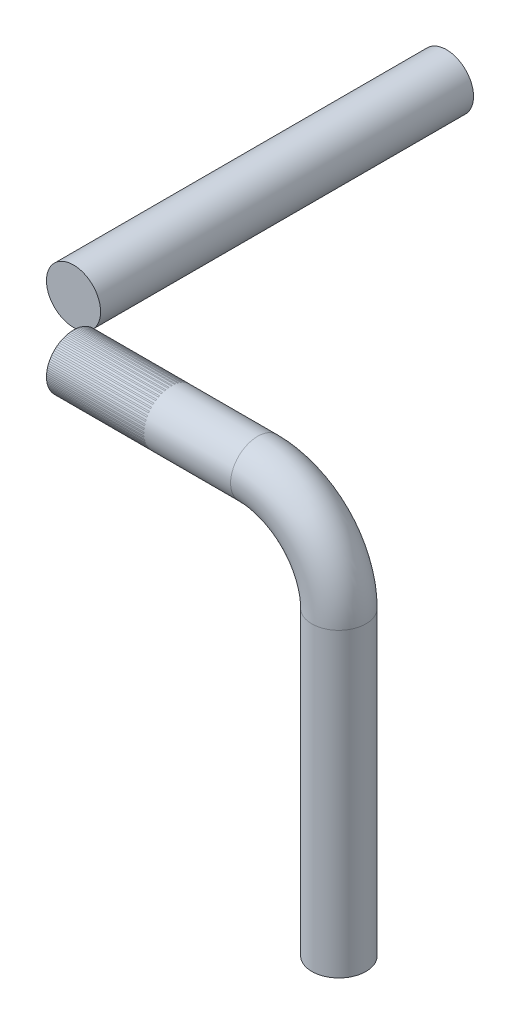
ISO-10303-21;
HEADER;
FILE_DESCRIPTION(('STEP AP214'),'2;1');
FILE_NAME('part.step','',(''),(''),'','','');
FILE_SCHEMA(('AUTOMOTIVE_DESIGN { 1 0 10303 214 1 1 1 1 }'));
ENDSEC;
DATA;
#1=APPLICATION_CONTEXT('core data for automotive mechanical design processes');
#2=APPLICATION_PROTOCOL_DEFINITION('international standard','automotive_design',2000,#1);
#3=PRODUCT_CONTEXT('',#1,'mechanical');
#4=PRODUCT('Part','Part','',(#3));
#5=PRODUCT_RELATED_PRODUCT_CATEGORY('part','',(#4));
#6=PRODUCT_DEFINITION_FORMATION('','',#4);
#7=PRODUCT_DEFINITION_CONTEXT('part definition',#1,'design');
#8=PRODUCT_DEFINITION('design','',#6,#7);
#9=PRODUCT_DEFINITION_SHAPE('','',#8);
#10=(LENGTH_UNIT() NAMED_UNIT(*) SI_UNIT(.MILLI.,.METRE.));
#11=(NAMED_UNIT(*) PLANE_ANGLE_UNIT() SI_UNIT($,.RADIAN.));
#12=(NAMED_UNIT(*) SI_UNIT($,.STERADIAN.) SOLID_ANGLE_UNIT());
#13=UNCERTAINTY_MEASURE_WITH_UNIT(LENGTH_MEASURE(1.E-05),#10,'distance_accuracy_value','');
#14=(GEOMETRIC_REPRESENTATION_CONTEXT(3) GLOBAL_UNCERTAINTY_ASSIGNED_CONTEXT((#13)) GLOBAL_UNIT_ASSIGNED_CONTEXT((#10,
#11,#12)) REPRESENTATION_CONTEXT('',''));
#15=CARTESIAN_POINT('',(0.,0.,0.));
#16=DIRECTION('',(0.,0.,1.));
#17=DIRECTION('',(1.,0.,0.));
#18=AXIS2_PLACEMENT_3D('',#15,#16,#17);
#19=CARTESIAN_POINT('',(0.,0.,84.0740000000007));
#20=DIRECTION('',(0.,0.,-1.));
#21=DIRECTION('',(-1.,0.,0.));
#22=AXIS2_PLACEMENT_3D('',#19,#20,#21);
#23=PLANE('',#22);
#24=CARTESIAN_POINT('',(0.,0.,84.0740000000007));
#25=DIRECTION('',(0.,0.,-1.));
#26=DIRECTION('',(-1.,0.,0.));
#27=AXIS2_PLACEMENT_3D('',#24,#25,#26);
#28=CIRCLE('',#27,6.35);
#29=CARTESIAN_POINT('',(-6.35,0.,84.0740000000007));
#30=VERTEX_POINT('',#29);
#31=EDGE_CURVE('E53',#30,#30,#28,.T.);
#32=ORIENTED_EDGE('',*,*,#31,.F.);
#33=EDGE_LOOP('',(#32));
#34=FACE_BOUND('',#33,.T.);
#35=ADVANCED_FACE('F46',(#34),#23,.F.);
#36=CARTESIAN_POINT('',(0.,0.,-21.3387122421383));
#37=DIRECTION('',(0.,0.,1.));
#38=DIRECTION('',(1.,0.,0.));
#39=AXIS2_PLACEMENT_3D('',#36,#37,#38);
#40=CYLINDRICAL_SURFACE('',#39,6.35);
#41=CARTESIAN_POINT('',(0.,0.,-3.37819999999999));
#42=DIRECTION('',(0.,0.,1.));
#43=DIRECTION('',(1.,0.,0.));
#44=AXIS2_PLACEMENT_3D('',#41,#42,#43);
#45=CIRCLE('',#44,6.35);
#46=CARTESIAN_POINT('',(6.35,0.,-3.37819999999999));
#47=VERTEX_POINT('',#46);
#48=EDGE_CURVE('E11',#47,#47,#45,.T.);
#49=ORIENTED_EDGE('',*,*,#48,.T.);
#50=EDGE_LOOP('',(#49));
#51=FACE_BOUND('',#50,.T.);
#52=ORIENTED_EDGE('',*,*,#31,.T.);
#53=EDGE_LOOP('',(#52));
#54=FACE_BOUND('',#53,.T.);
#55=ADVANCED_FACE('F48',(#51,#54),#40,.T.);
#56=CARTESIAN_POINT('',(0.,0.,-3.37819999999999));
#57=DIRECTION('',(0.,0.,1.));
#58=DIRECTION('',(1.,0.,0.));
#59=AXIS2_PLACEMENT_3D('',#56,#57,#58);
#60=PLANE('',#59);
#61=ORIENTED_EDGE('',*,*,#48,.F.);
#62=EDGE_LOOP('',(#61));
#63=FACE_BOUND('',#62,.T.);
#64=ADVANCED_FACE('F64',(#63),#60,.F.);
#65=CLOSED_SHELL('',(#35,#55,#64));
#66=MANIFOLD_SOLID_BREP('B2',#65);
#67=CARTESIAN_POINT('',(56.3814706539702,-3.60822483003176E-13,97.2819999985061));
#68=DIRECTION('',(-1.,0.,0.));
#69=DIRECTION('',(0.,-1.,0.));
#70=AXIS2_PLACEMENT_3D('',#67,#68,#69);
#71=CYLINDRICAL_SURFACE('',#70,6.34999999999999);
#72=CARTESIAN_POINT('',(56.3814706539702,-3.60822483003176E-13,97.2819999985061));
#73=DIRECTION('',(1.,0.,0.));
#74=DIRECTION('',(0.,0.,-1.));
#75=AXIS2_PLACEMENT_3D('',#72,#73,#74);
#76=CIRCLE('',#75,6.34999999999999);
#77=CARTESIAN_POINT('',(56.3814706539702,6.34999999999963,97.2819999985061));
#78=VERTEX_POINT('',#77);
#79=EDGE_CURVE('E101',#78,#78,#76,.T.);
#80=ORIENTED_EDGE('',*,*,#79,.F.);
#81=EDGE_LOOP('',(#80));
#82=FACE_BOUND('',#81,.T.);
#83=CARTESIAN_POINT('',(13.2080000000033,9.34153308865755E-13,97.2819999985061));
#84=DIRECTION('',(1.,0.,0.));
#85=DIRECTION('',(0.,0.,-1.));
#86=AXIS2_PLACEMENT_3D('',#83,#84,#85);
#87=CIRCLE('',#86,6.34999999999999);
#88=CARTESIAN_POINT('',(13.2080000000033,9.34153308865755E-13,90.9319999985061));
#89=VERTEX_POINT('',#88);
#90=EDGE_CURVE('E45',#89,#89,#87,.T.);
#91=ORIENTED_EDGE('',*,*,#90,.T.);
#92=EDGE_LOOP('',(#91));
#93=FACE_BOUND('',#92,.T.);
#94=ADVANCED_FACE('F95',(#82,#93),#71,.T.);
#95=CARTESIAN_POINT('',(56.3814706539702,-19.05,97.2819999985061));
#96=DIRECTION('',(0.,0.,1.));
#97=DIRECTION('',(1.,0.,0.));
#98=AXIS2_PLACEMENT_3D('',#95,#96,#97);
#99=TOROIDAL_SURFACE('',#98,19.0499999999996,6.34999999999999);
#100=CARTESIAN_POINT('',(75.4314706539698,-19.05,97.2819999985061));
#101=DIRECTION('',(0.,-1.,0.));
#102=DIRECTION('',(0.,0.,-1.));
#103=AXIS2_PLACEMENT_3D('',#100,#101,#102);
#104=CIRCLE('',#103,6.34999999999999);
#105=CARTESIAN_POINT('',(81.7814706539698,-19.05,97.2819999985061));
#106=VERTEX_POINT('',#105);
#107=EDGE_CURVE('E105',#106,#106,#104,.T.);
#108=CARTESIAN_POINT('',(56.3814706539702,-19.05,97.2819999985061));
#109=DIRECTION('',(0.,0.,1.));
#110=DIRECTION('',(1.,0.,0.));
#111=AXIS2_PLACEMENT_3D('',#108,#109,#110);
#112=CIRCLE('',#111,25.3999999999996);
#113=EDGE_CURVE('',#106,#78,#112,.T.);
#114=ORIENTED_EDGE('',*,*,#107,.F.);
#115=ORIENTED_EDGE('',*,*,#79,.T.);
#116=ORIENTED_EDGE('',*,*,#113,.T.);
#117=ORIENTED_EDGE('',*,*,#113,.F.);
#118=EDGE_LOOP('',(#114,#116,#115,#117));
#119=FACE_BOUND('',#118,.T.);
#120=ADVANCED_FACE('F120',(#119),#99,.T.);
#121=CARTESIAN_POINT('',(75.4314706539698,-19.05,97.2819999985061));
#122=DIRECTION('',(0.,-1.,0.));
#123=DIRECTION('',(0.,0.,-1.));
#124=AXIS2_PLACEMENT_3D('',#121,#122,#123);
#125=CYLINDRICAL_SURFACE('',#124,6.34999999999999);
#126=ORIENTED_EDGE('',*,*,#107,.T.);
#127=EDGE_LOOP('',(#126));
#128=FACE_BOUND('',#127,.T.);
#129=CARTESIAN_POINT('',(75.4314706539698,-89.6526500374171,97.2819999985061));
#130=DIRECTION('',(0.,-1.,0.));
#131=DIRECTION('',(0.,0.,-1.));
#132=AXIS2_PLACEMENT_3D('',#129,#130,#131);
#133=CIRCLE('',#132,6.34999999999999);
#134=CARTESIAN_POINT('',(75.4314706539698,-89.6526500374171,90.9319999985061));
#135=VERTEX_POINT('',#134);
#136=EDGE_CURVE('E109',#135,#135,#133,.T.);
#137=ORIENTED_EDGE('',*,*,#136,.F.);
#138=EDGE_LOOP('',(#137));
#139=FACE_BOUND('',#138,.T.);
#140=ADVANCED_FACE('F117',(#128,#139),#125,.T.);
#141=CARTESIAN_POINT('',(13.2080000000033,9.34153308865755E-13,97.2819999985061));
#142=DIRECTION('',(1.,0.,0.));
#143=DIRECTION('',(0.,0.,-1.));
#144=AXIS2_PLACEMENT_3D('',#141,#142,#143);
#145=PLANE('',#144);
#146=ORIENTED_EDGE('',*,*,#90,.F.);
#147=EDGE_LOOP('',(#146));
#148=FACE_BOUND('',#147,.T.);
#149=ADVANCED_FACE('F119',(#148),#145,.F.);
#150=CARTESIAN_POINT('',(75.4314706539698,-89.6526500374171,97.2819999985061));
#151=DIRECTION('',(0.,-1.,0.));
#152=DIRECTION('',(0.,0.,-1.));
#153=AXIS2_PLACEMENT_3D('',#150,#151,#152);
#154=PLANE('',#153);
#155=ORIENTED_EDGE('',*,*,#136,.T.);
#156=EDGE_LOOP('',(#155));
#157=FACE_BOUND('',#156,.T.);
#158=ADVANCED_FACE('F115',(#157),#154,.T.);
#159=CLOSED_SHELL('',(#94,#120,#140,#149,#158));
#160=MANIFOLD_SOLID_BREP('B6',#159);
#161=CARTESIAN_POINT('',(24.6380000000033,-2.12774731213363E-11,97.2819999987778));
#162=DIRECTION('',(-1.,0.,0.));
#163=DIRECTION('',(0.,-1.32485968820828E-12,1.));
#164=AXIS2_PLACEMENT_3D('',#161,#162,#163);
#165=CYLINDRICAL_SURFACE('',#164,6.35);
#166=CARTESIAN_POINT('',(36.0680000000033,-2.16375495365337E-11,97.2819999987778));
#167=DIRECTION('',(-1.,0.,0.));
#168=DIRECTION('',(0.,-1.32485968820828E-12,1.));
#169=AXIS2_PLACEMENT_3D('',#166,#167,#168);
#170=CIRCLE('',#169,6.35);
#171=CARTESIAN_POINT('',(36.0680000000033,-3.00504085566563E-11,103.631999998778));
#172=VERTEX_POINT('',#171);
#173=EDGE_CURVE('E178',#172,#172,#170,.T.);
#174=ORIENTED_EDGE('',*,*,#173,.F.);
#175=EDGE_LOOP('',(#174));
#176=FACE_BOUND('',#175,.T.);
#177=CARTESIAN_POINT('',(13.2080000000033,-2.09173967061389E-11,97.2819999987778));
#178=DIRECTION('',(-1.,0.,0.));
#179=DIRECTION('',(0.,-1.32485968820828E-12,1.));
#180=AXIS2_PLACEMENT_3D('',#177,#178,#179);
#181=CIRCLE('',#180,6.35);
#182=CARTESIAN_POINT('',(13.2080000000033,-2.93302557262615E-11,103.631999998778));
#183=VERTEX_POINT('',#182);
#184=EDGE_CURVE('E94',#183,#183,#181,.F.);
#185=ORIENTED_EDGE('',*,*,#184,.F.);
#186=EDGE_LOOP('',(#185));
#187=FACE_BOUND('',#186,.T.);
#188=ADVANCED_FACE('F174',(#176,#187),#165,.F.);
#189=OPEN_SHELL('',(#188));
#190=SHELL_BASED_SURFACE_MODEL('B40',(#189));
#191=ADVANCED_BREP_SHAPE_REPRESENTATION('',(#18,#66,#160),#14);
#192=MANIFOLD_SURFACE_SHAPE_REPRESENTATION('',(#18,#190),#14);
#193=SHAPE_REPRESENTATION('',(#18),#14);
#194=SHAPE_DEFINITION_REPRESENTATION(#9,#193);
#195=SHAPE_REPRESENTATION_RELATIONSHIP('','',#193,#191);
#196=SHAPE_REPRESENTATION_RELATIONSHIP('','',#193,#192);
ENDSEC;
END-ISO-10303-21;
